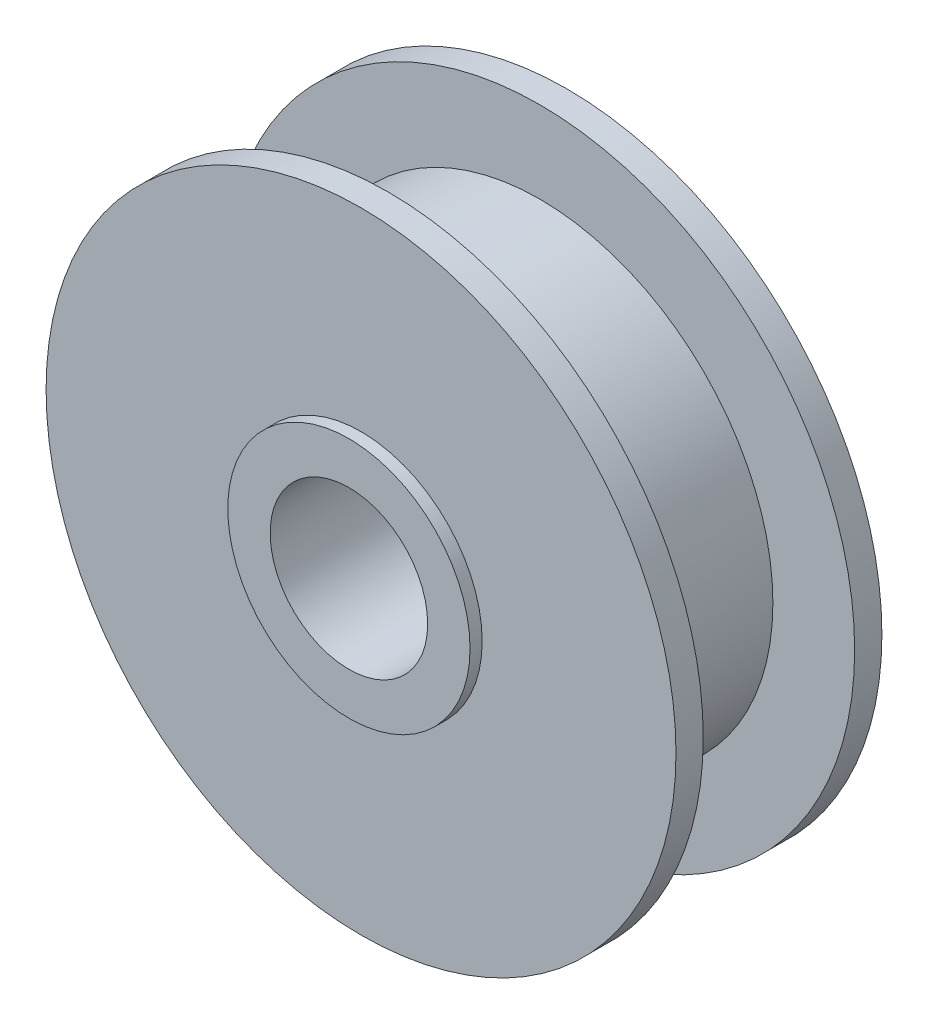
ISO-10303-21;
HEADER;
FILE_DESCRIPTION(('STEP AP214'),'2;1');
FILE_NAME('part.step','',(''),(''),'','','');
FILE_SCHEMA(('AUTOMOTIVE_DESIGN { 1 0 10303 214 1 1 1 1 }'));
ENDSEC;
DATA;
#1=APPLICATION_CONTEXT('core data for automotive mechanical design processes');
#2=APPLICATION_PROTOCOL_DEFINITION('international standard','automotive_design',2000,#1);
#3=PRODUCT_CONTEXT('',#1,'mechanical');
#4=PRODUCT('Part','Part','',(#3));
#5=PRODUCT_RELATED_PRODUCT_CATEGORY('part','',(#4));
#6=PRODUCT_DEFINITION_FORMATION('','',#4);
#7=PRODUCT_DEFINITION_CONTEXT('part definition',#1,'design');
#8=PRODUCT_DEFINITION('design','',#6,#7);
#9=PRODUCT_DEFINITION_SHAPE('','',#8);
#10=(LENGTH_UNIT() NAMED_UNIT(*) SI_UNIT(.MILLI.,.METRE.));
#11=(NAMED_UNIT(*) PLANE_ANGLE_UNIT() SI_UNIT($,.RADIAN.));
#12=(NAMED_UNIT(*) SI_UNIT($,.STERADIAN.) SOLID_ANGLE_UNIT());
#13=UNCERTAINTY_MEASURE_WITH_UNIT(LENGTH_MEASURE(1.E-05),#10,'distance_accuracy_value','');
#14=(GEOMETRIC_REPRESENTATION_CONTEXT(3) GLOBAL_UNCERTAINTY_ASSIGNED_CONTEXT((#13)) GLOBAL_UNIT_ASSIGNED_CONTEXT((#10,
#11,#12)) REPRESENTATION_CONTEXT('',''));
#15=CARTESIAN_POINT('',(0.,0.,0.));
#16=DIRECTION('',(0.,0.,1.));
#17=DIRECTION('',(1.,0.,0.));
#18=AXIS2_PLACEMENT_3D('',#15,#16,#17);
#19=CARTESIAN_POINT('',(0.,0.,1.9));
#20=DIRECTION('',(0.,0.,1.));
#21=DIRECTION('',(1.,0.,0.));
#22=AXIS2_PLACEMENT_3D('',#19,#20,#21);
#23=CYLINDRICAL_SURFACE('',#22,1.3);
#24=CARTESIAN_POINT('',(0.,0.,-1.9));
#25=DIRECTION('',(0.,0.,1.));
#26=DIRECTION('',(1.,0.,0.));
#27=AXIS2_PLACEMENT_3D('',#24,#25,#26);
#28=CIRCLE('',#27,1.3);
#29=CARTESIAN_POINT('',(1.3,0.,-1.9));
#30=VERTEX_POINT('',#29);
#31=EDGE_CURVE('E71',#30,#30,#28,.T.);
#32=ORIENTED_EDGE('',*,*,#31,.F.);
#33=EDGE_LOOP('',(#32));
#34=FACE_BOUND('',#33,.T.);
#35=CARTESIAN_POINT('',(0.,0.,1.9));
#36=DIRECTION('',(0.,0.,1.));
#37=DIRECTION('',(1.,0.,0.));
#38=AXIS2_PLACEMENT_3D('',#35,#36,#37);
#39=CIRCLE('',#38,1.3);
#40=CARTESIAN_POINT('',(1.3,0.,1.9));
#41=VERTEX_POINT('',#40);
#42=EDGE_CURVE('E10',#41,#41,#39,.T.);
#43=ORIENTED_EDGE('',*,*,#42,.T.);
#44=EDGE_LOOP('',(#43));
#45=FACE_BOUND('',#44,.T.);
#46=ADVANCED_FACE('F31',(#34,#45),#23,.F.);
#47=CARTESIAN_POINT('',(0.,1.3,1.9));
#48=DIRECTION('',(0.,0.,-1.));
#49=DIRECTION('',(-1.,0.,0.));
#50=AXIS2_PLACEMENT_3D('',#47,#48,#49);
#51=PLANE('',#50);
#52=ORIENTED_EDGE('',*,*,#42,.F.);
#53=EDGE_LOOP('',(#52));
#54=FACE_BOUND('',#53,.T.);
#55=CARTESIAN_POINT('',(0.,0.,1.9));
#56=DIRECTION('',(0.,0.,1.));
#57=DIRECTION('',(1.,0.,0.));
#58=AXIS2_PLACEMENT_3D('',#55,#56,#57);
#59=CIRCLE('',#58,2.);
#60=CARTESIAN_POINT('',(2.,0.,1.9));
#61=VERTEX_POINT('',#60);
#62=EDGE_CURVE('E37',#61,#61,#59,.T.);
#63=ORIENTED_EDGE('',*,*,#62,.T.);
#64=EDGE_LOOP('',(#63));
#65=FACE_BOUND('',#64,.T.);
#66=ADVANCED_FACE('F78',(#54,#65),#51,.F.);
#67=CARTESIAN_POINT('',(0.,0.,1.9));
#68=DIRECTION('',(0.,0.,1.));
#69=DIRECTION('',(1.,0.,0.));
#70=AXIS2_PLACEMENT_3D('',#67,#68,#69);
#71=CYLINDRICAL_SURFACE('',#70,2.);
#72=ORIENTED_EDGE('',*,*,#62,.F.);
#73=EDGE_LOOP('',(#72));
#74=FACE_BOUND('',#73,.T.);
#75=CARTESIAN_POINT('',(0.,0.,1.7));
#76=DIRECTION('',(0.,0.,1.));
#77=DIRECTION('',(1.,0.,0.));
#78=AXIS2_PLACEMENT_3D('',#75,#76,#77);
#79=CIRCLE('',#78,2.);
#80=CARTESIAN_POINT('',(2.,0.,1.7));
#81=VERTEX_POINT('',#80);
#82=EDGE_CURVE('E41',#81,#81,#79,.T.);
#83=ORIENTED_EDGE('',*,*,#82,.T.);
#84=EDGE_LOOP('',(#83));
#85=FACE_BOUND('',#84,.T.);
#86=ADVANCED_FACE('F82',(#74,#85),#71,.T.);
#87=CARTESIAN_POINT('',(0.,2.,1.7));
#88=DIRECTION('',(0.,0.,-1.));
#89=DIRECTION('',(-1.,0.,0.));
#90=AXIS2_PLACEMENT_3D('',#87,#88,#89);
#91=PLANE('',#90);
#92=ORIENTED_EDGE('',*,*,#82,.F.);
#93=EDGE_LOOP('',(#92));
#94=FACE_BOUND('',#93,.T.);
#95=CARTESIAN_POINT('',(0.,0.,1.7));
#96=DIRECTION('',(0.,0.,1.));
#97=DIRECTION('',(1.,0.,0.));
#98=AXIS2_PLACEMENT_3D('',#95,#96,#97);
#99=CIRCLE('',#98,5.2);
#100=CARTESIAN_POINT('',(5.2,0.,1.7));
#101=VERTEX_POINT('',#100);
#102=EDGE_CURVE('E45',#101,#101,#99,.T.);
#103=ORIENTED_EDGE('',*,*,#102,.T.);
#104=EDGE_LOOP('',(#103));
#105=FACE_BOUND('',#104,.T.);
#106=ADVANCED_FACE('F87',(#94,#105),#91,.F.);
#107=CARTESIAN_POINT('',(0.,0.,1.9));
#108=DIRECTION('',(0.,0.,1.));
#109=DIRECTION('',(1.,0.,0.));
#110=AXIS2_PLACEMENT_3D('',#107,#108,#109);
#111=CYLINDRICAL_SURFACE('',#110,5.2);
#112=ORIENTED_EDGE('',*,*,#102,.F.);
#113=EDGE_LOOP('',(#112));
#114=FACE_BOUND('',#113,.T.);
#115=CARTESIAN_POINT('',(0.,0.,1.25));
#116=DIRECTION('',(0.,0.,1.));
#117=DIRECTION('',(1.,0.,0.));
#118=AXIS2_PLACEMENT_3D('',#115,#116,#117);
#119=CIRCLE('',#118,5.2);
#120=CARTESIAN_POINT('',(5.2,0.,1.25));
#121=VERTEX_POINT('',#120);
#122=EDGE_CURVE('E50',#121,#121,#119,.T.);
#123=ORIENTED_EDGE('',*,*,#122,.T.);
#124=EDGE_LOOP('',(#123));
#125=FACE_BOUND('',#124,.T.);
#126=ADVANCED_FACE('F93',(#114,#125),#111,.T.);
#127=CARTESIAN_POINT('',(0.,5.2,1.25));
#128=DIRECTION('',(0.,0.,1.));
#129=DIRECTION('',(1.,0.,0.));
#130=AXIS2_PLACEMENT_3D('',#127,#128,#129);
#131=PLANE('',#130);
#132=ORIENTED_EDGE('',*,*,#122,.F.);
#133=EDGE_LOOP('',(#132));
#134=FACE_BOUND('',#133,.T.);
#135=CARTESIAN_POINT('',(0.,0.,1.25));
#136=DIRECTION('',(0.,0.,1.));
#137=DIRECTION('',(1.,0.,0.));
#138=AXIS2_PLACEMENT_3D('',#135,#136,#137);
#139=CIRCLE('',#138,3.85);
#140=CARTESIAN_POINT('',(3.85,0.,1.25));
#141=VERTEX_POINT('',#140);
#142=EDGE_CURVE('E53',#141,#141,#139,.T.);
#143=ORIENTED_EDGE('',*,*,#142,.T.);
#144=EDGE_LOOP('',(#143));
#145=FACE_BOUND('',#144,.T.);
#146=ADVANCED_FACE('F97',(#134,#145),#131,.F.);
#147=CARTESIAN_POINT('',(0.,0.,1.9));
#148=DIRECTION('',(0.,0.,1.));
#149=DIRECTION('',(1.,0.,0.));
#150=AXIS2_PLACEMENT_3D('',#147,#148,#149);
#151=CYLINDRICAL_SURFACE('',#150,3.85);
#152=ORIENTED_EDGE('',*,*,#142,.F.);
#153=EDGE_LOOP('',(#152));
#154=FACE_BOUND('',#153,.T.);
#155=CARTESIAN_POINT('',(0.,0.,-1.25));
#156=DIRECTION('',(0.,0.,1.));
#157=DIRECTION('',(1.,0.,0.));
#158=AXIS2_PLACEMENT_3D('',#155,#156,#157);
#159=CIRCLE('',#158,3.85);
#160=CARTESIAN_POINT('',(3.85,0.,-1.25));
#161=VERTEX_POINT('',#160);
#162=EDGE_CURVE('E56',#161,#161,#159,.T.);
#163=ORIENTED_EDGE('',*,*,#162,.T.);
#164=EDGE_LOOP('',(#163));
#165=FACE_BOUND('',#164,.T.);
#166=ADVANCED_FACE('F101',(#154,#165),#151,.T.);
#167=CARTESIAN_POINT('',(0.,3.85,-1.25));
#168=DIRECTION('',(0.,0.,-1.));
#169=DIRECTION('',(-1.,0.,0.));
#170=AXIS2_PLACEMENT_3D('',#167,#168,#169);
#171=PLANE('',#170);
#172=ORIENTED_EDGE('',*,*,#162,.F.);
#173=EDGE_LOOP('',(#172));
#174=FACE_BOUND('',#173,.T.);
#175=CARTESIAN_POINT('',(0.,0.,-1.25));
#176=DIRECTION('',(0.,0.,1.));
#177=DIRECTION('',(1.,0.,0.));
#178=AXIS2_PLACEMENT_3D('',#175,#176,#177);
#179=CIRCLE('',#178,5.2);
#180=CARTESIAN_POINT('',(5.2,0.,-1.25));
#181=VERTEX_POINT('',#180);
#182=EDGE_CURVE('E59',#181,#181,#179,.T.);
#183=ORIENTED_EDGE('',*,*,#182,.T.);
#184=EDGE_LOOP('',(#183));
#185=FACE_BOUND('',#184,.T.);
#186=ADVANCED_FACE('F105',(#174,#185),#171,.F.);
#187=CARTESIAN_POINT('',(0.,0.,1.9));
#188=DIRECTION('',(0.,0.,1.));
#189=DIRECTION('',(1.,0.,0.));
#190=AXIS2_PLACEMENT_3D('',#187,#188,#189);
#191=CYLINDRICAL_SURFACE('',#190,5.2);
#192=ORIENTED_EDGE('',*,*,#182,.F.);
#193=EDGE_LOOP('',(#192));
#194=FACE_BOUND('',#193,.T.);
#195=CARTESIAN_POINT('',(0.,0.,-1.7));
#196=DIRECTION('',(0.,0.,1.));
#197=DIRECTION('',(1.,0.,0.));
#198=AXIS2_PLACEMENT_3D('',#195,#196,#197);
#199=CIRCLE('',#198,5.2);
#200=CARTESIAN_POINT('',(5.2,0.,-1.7));
#201=VERTEX_POINT('',#200);
#202=EDGE_CURVE('E62',#201,#201,#199,.T.);
#203=ORIENTED_EDGE('',*,*,#202,.T.);
#204=EDGE_LOOP('',(#203));
#205=FACE_BOUND('',#204,.T.);
#206=ADVANCED_FACE('F109',(#194,#205),#191,.T.);
#207=CARTESIAN_POINT('',(0.,5.2,-1.7));
#208=DIRECTION('',(0.,0.,1.));
#209=DIRECTION('',(1.,0.,0.));
#210=AXIS2_PLACEMENT_3D('',#207,#208,#209);
#211=PLANE('',#210);
#212=ORIENTED_EDGE('',*,*,#202,.F.);
#213=EDGE_LOOP('',(#212));
#214=FACE_BOUND('',#213,.T.);
#215=CARTESIAN_POINT('',(0.,0.,-1.7));
#216=DIRECTION('',(0.,0.,1.));
#217=DIRECTION('',(1.,0.,0.));
#218=AXIS2_PLACEMENT_3D('',#215,#216,#217);
#219=CIRCLE('',#218,2.);
#220=CARTESIAN_POINT('',(2.,0.,-1.7));
#221=VERTEX_POINT('',#220);
#222=EDGE_CURVE('E65',#221,#221,#219,.T.);
#223=ORIENTED_EDGE('',*,*,#222,.T.);
#224=EDGE_LOOP('',(#223));
#225=FACE_BOUND('',#224,.T.);
#226=ADVANCED_FACE('F113',(#214,#225),#211,.F.);
#227=CARTESIAN_POINT('',(0.,0.,1.9));
#228=DIRECTION('',(0.,0.,1.));
#229=DIRECTION('',(1.,0.,0.));
#230=AXIS2_PLACEMENT_3D('',#227,#228,#229);
#231=CYLINDRICAL_SURFACE('',#230,2.);
#232=ORIENTED_EDGE('',*,*,#222,.F.);
#233=EDGE_LOOP('',(#232));
#234=FACE_BOUND('',#233,.T.);
#235=CARTESIAN_POINT('',(0.,0.,-1.9));
#236=DIRECTION('',(0.,0.,1.));
#237=DIRECTION('',(1.,0.,0.));
#238=AXIS2_PLACEMENT_3D('',#235,#236,#237);
#239=CIRCLE('',#238,2.);
#240=CARTESIAN_POINT('',(2.,0.,-1.9));
#241=VERTEX_POINT('',#240);
#242=EDGE_CURVE('E68',#241,#241,#239,.T.);
#243=ORIENTED_EDGE('',*,*,#242,.T.);
#244=EDGE_LOOP('',(#243));
#245=FACE_BOUND('',#244,.T.);
#246=ADVANCED_FACE('F117',(#234,#245),#231,.T.);
#247=CARTESIAN_POINT('',(0.,2.,-1.9));
#248=DIRECTION('',(0.,0.,1.));
#249=DIRECTION('',(1.,0.,0.));
#250=AXIS2_PLACEMENT_3D('',#247,#248,#249);
#251=PLANE('',#250);
#252=ORIENTED_EDGE('',*,*,#242,.F.);
#253=EDGE_LOOP('',(#252));
#254=FACE_BOUND('',#253,.T.);
#255=ORIENTED_EDGE('',*,*,#31,.T.);
#256=EDGE_LOOP('',(#255));
#257=FACE_BOUND('',#256,.T.);
#258=ADVANCED_FACE('F75',(#254,#257),#251,.F.);
#259=CLOSED_SHELL('',(#46,#66,#86,#106,#126,#146,#166,#186,#206,#226,#246,#258));
#260=MANIFOLD_SOLID_BREP('B2',#259);
#261=ADVANCED_BREP_SHAPE_REPRESENTATION('',(#18,#260),#14);
#262=SHAPE_DEFINITION_REPRESENTATION(#9,#261);
ENDSEC;
END-ISO-10303-21;
